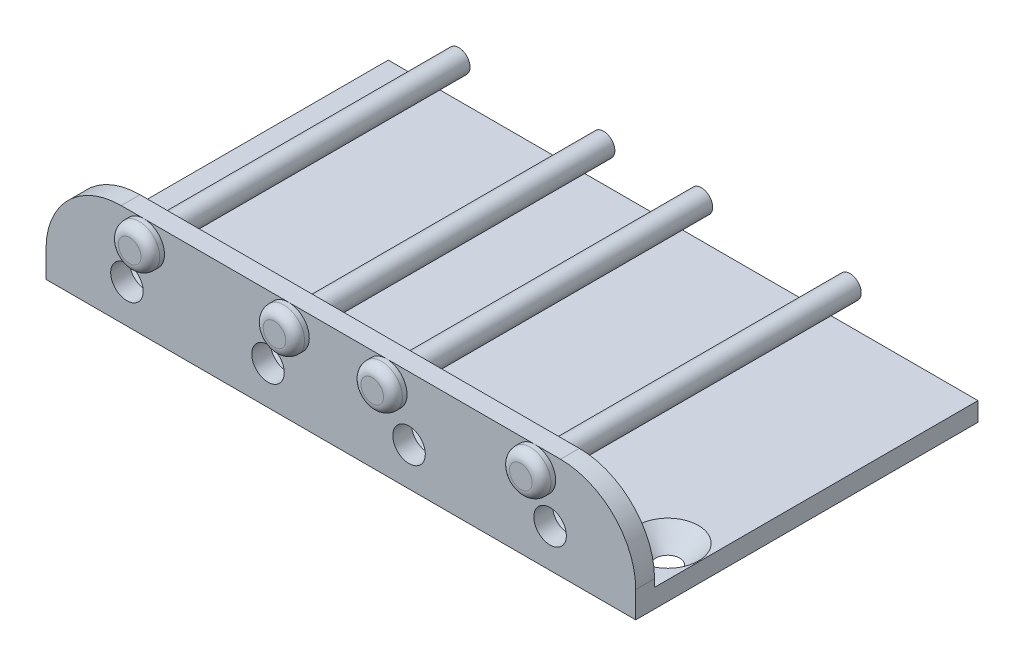
ISO-10303-21;
HEADER;
FILE_DESCRIPTION(('STEP AP214'),'2;1');
FILE_NAME('part.step','',(''),(''),'','','');
FILE_SCHEMA(('AUTOMOTIVE_DESIGN { 1 0 10303 214 1 1 1 1 }'));
ENDSEC;
DATA;
#1=APPLICATION_CONTEXT('core data for automotive mechanical design processes');
#2=APPLICATION_PROTOCOL_DEFINITION('international standard','automotive_design',2000,#1);
#3=PRODUCT_CONTEXT('',#1,'mechanical');
#4=PRODUCT('Part','Part','',(#3));
#5=PRODUCT_RELATED_PRODUCT_CATEGORY('part','',(#4));
#6=PRODUCT_DEFINITION_FORMATION('','',#4);
#7=PRODUCT_DEFINITION_CONTEXT('part definition',#1,'design');
#8=PRODUCT_DEFINITION('design','',#6,#7);
#9=PRODUCT_DEFINITION_SHAPE('','',#8);
#10=(LENGTH_UNIT() NAMED_UNIT(*) SI_UNIT(.MILLI.,.METRE.));
#11=(NAMED_UNIT(*) PLANE_ANGLE_UNIT() SI_UNIT($,.RADIAN.));
#12=(NAMED_UNIT(*) SI_UNIT($,.STERADIAN.) SOLID_ANGLE_UNIT());
#13=UNCERTAINTY_MEASURE_WITH_UNIT(LENGTH_MEASURE(1.E-05),#10,'distance_accuracy_value','');
#14=(GEOMETRIC_REPRESENTATION_CONTEXT(3) GLOBAL_UNCERTAINTY_ASSIGNED_CONTEXT((#13)) GLOBAL_UNIT_ASSIGNED_CONTEXT((#10,
#11,#12)) REPRESENTATION_CONTEXT('',''));
#15=CARTESIAN_POINT('',(0.,0.,0.));
#16=DIRECTION('',(0.,0.,1.));
#17=DIRECTION('',(1.,0.,0.));
#18=AXIS2_PLACEMENT_3D('',#15,#16,#17);
#19=CARTESIAN_POINT('',(0.,2.54,0.));
#20=DIRECTION('',(1.,0.,0.));
#21=DIRECTION('',(0.,0.,-1.));
#22=AXIS2_PLACEMENT_3D('',#19,#20,#21);
#23=PLANE('',#22);
#24=DIRECTION('',(0.,-1.,0.));
#25=VECTOR('',#24,1.);
#26=CARTESIAN_POINT('',(0.,2.54,0.));
#27=LINE('',#26,#25);
#28=CARTESIAN_POINT('',(0.,3.556,0.));
#29=VERTEX_POINT('',#28);
#30=CARTESIAN_POINT('',(0.,0.,0.));
#31=VERTEX_POINT('',#30);
#32=EDGE_CURVE('E223',#29,#31,#27,.T.);
#33=ORIENTED_EDGE('',*,*,#32,.F.);
#34=DIRECTION('',(0.,0.,-1.));
#35=VECTOR('',#34,1.);
#36=CARTESIAN_POINT('',(0.,3.556,-2.54));
#37=LINE('',#36,#35);
#38=CARTESIAN_POINT('',(0.,3.556,-2.54));
#39=VERTEX_POINT('',#38);
#40=EDGE_CURVE('E238',#29,#39,#37,.T.);
#41=ORIENTED_EDGE('',*,*,#40,.T.);
#42=DIRECTION('',(0.,-1.,0.));
#43=VECTOR('',#42,1.);
#44=CARTESIAN_POINT('',(0.,13.716,-2.54));
#45=LINE('',#44,#43);
#46=CARTESIAN_POINT('',(0.,2.54,-2.54));
#47=VERTEX_POINT('',#46);
#48=EDGE_CURVE('E151',#39,#47,#45,.T.);
#49=ORIENTED_EDGE('',*,*,#48,.T.);
#50=DIRECTION('',(0.,0.,1.));
#51=VECTOR('',#50,1.);
#52=CARTESIAN_POINT('',(0.,2.54,0.));
#53=LINE('',#52,#51);
#54=CARTESIAN_POINT('',(0.,2.54,-46.228));
#55=VERTEX_POINT('',#54);
#56=EDGE_CURVE('E463',#55,#47,#53,.T.);
#57=ORIENTED_EDGE('',*,*,#56,.F.);
#58=DIRECTION('',(0.,-1.,0.));
#59=VECTOR('',#58,1.);
#60=CARTESIAN_POINT('',(0.,2.54,-46.228));
#61=LINE('',#60,#59);
#62=CARTESIAN_POINT('',(0.,0.,-46.228));
#63=VERTEX_POINT('',#62);
#64=EDGE_CURVE('E464',#55,#63,#61,.T.);
#65=ORIENTED_EDGE('',*,*,#64,.T.);
#66=DIRECTION('',(0.,0.,1.));
#67=VECTOR('',#66,1.);
#68=CARTESIAN_POINT('',(0.,0.,0.));
#69=LINE('',#68,#67);
#70=EDGE_CURVE('E157',#63,#31,#69,.T.);
#71=ORIENTED_EDGE('',*,*,#70,.T.);
#72=EDGE_LOOP('',(#33,#41,#49,#57,#65,#71));
#73=FACE_BOUND('',#72,.T.);
#74=ADVANCED_FACE('F47',(#73),#23,.F.);
#75=CARTESIAN_POINT('',(0.,2.54,0.));
#76=DIRECTION('',(0.,0.,-1.));
#77=DIRECTION('',(-1.,0.,0.));
#78=AXIS2_PLACEMENT_3D('',#75,#76,#77);
#79=PLANE('',#78);
#80=CARTESIAN_POINT('',(10.9347,5.1689,0.));
#81=DIRECTION('',(0.,0.,1.));
#82=DIRECTION('',(1.,0.,0.));
#83=AXIS2_PLACEMENT_3D('',#80,#81,#82);
#84=CIRCLE('',#83,2.1971);
#85=CARTESIAN_POINT('',(13.1318,5.1689,0.));
#86=VERTEX_POINT('',#85);
#87=EDGE_CURVE('E181',#86,#86,#84,.T.);
#88=ORIENTED_EDGE('',*,*,#87,.F.);
#89=EDGE_LOOP('',(#88));
#90=FACE_BOUND('',#89,.T.);
#91=CARTESIAN_POINT('',(29.9847,5.1689,0.));
#92=DIRECTION('',(0.,0.,1.));
#93=DIRECTION('',(1.,0.,0.));
#94=AXIS2_PLACEMENT_3D('',#91,#92,#93);
#95=CIRCLE('',#94,2.1971);
#96=CARTESIAN_POINT('',(32.1818,5.1689,0.));
#97=VERTEX_POINT('',#96);
#98=EDGE_CURVE('E186',#97,#97,#95,.T.);
#99=ORIENTED_EDGE('',*,*,#98,.F.);
#100=EDGE_LOOP('',(#99));
#101=FACE_BOUND('',#100,.T.);
#102=CARTESIAN_POINT('',(49.0347,5.1689,0.));
#103=DIRECTION('',(0.,0.,1.));
#104=DIRECTION('',(1.,0.,0.));
#105=AXIS2_PLACEMENT_3D('',#102,#103,#104);
#106=CIRCLE('',#105,2.1971);
#107=CARTESIAN_POINT('',(51.2318,5.1689,0.));
#108=VERTEX_POINT('',#107);
#109=EDGE_CURVE('E190',#108,#108,#106,.T.);
#110=ORIENTED_EDGE('',*,*,#109,.F.);
#111=EDGE_LOOP('',(#110));
#112=FACE_BOUND('',#111,.T.);
#113=CARTESIAN_POINT('',(68.0847,5.1689,0.));
#114=DIRECTION('',(0.,0.,1.));
#115=DIRECTION('',(1.,0.,0.));
#116=AXIS2_PLACEMENT_3D('',#113,#114,#115);
#117=CIRCLE('',#116,2.1971);
#118=CARTESIAN_POINT('',(70.2818,5.1689,0.));
#119=VERTEX_POINT('',#118);
#120=EDGE_CURVE('E180',#119,#119,#117,.T.);
#121=ORIENTED_EDGE('',*,*,#120,.F.);
#122=EDGE_LOOP('',(#121));
#123=FACE_BOUND('',#122,.T.);
#124=DIRECTION('',(0.,-1.,0.));
#125=VECTOR('',#124,1.);
#126=CARTESIAN_POINT('',(79.6544,2.54,0.));
#127=LINE('',#126,#125);
#128=CARTESIAN_POINT('',(79.6544,3.556,0.));
#129=VERTEX_POINT('',#128);
#130=CARTESIAN_POINT('',(79.6544,0.,0.));
#131=VERTEX_POINT('',#130);
#132=EDGE_CURVE('E471',#129,#131,#127,.T.);
#133=ORIENTED_EDGE('',*,*,#132,.F.);
#134=CARTESIAN_POINT('',(69.4944,3.556,0.));
#135=DIRECTION('',(0.,0.,-1.));
#136=DIRECTION('',(-1.,0.,0.));
#137=AXIS2_PLACEMENT_3D('',#134,#135,#136);
#138=CIRCLE('',#137,10.16);
#139=CARTESIAN_POINT('',(69.4944,13.716,0.));
#140=VERTEX_POINT('',#139);
#141=EDGE_CURVE('E142',#129,#140,#138,.F.);
#142=ORIENTED_EDGE('',*,*,#141,.T.);
#143=DIRECTION('',(1.,0.,0.));
#144=VECTOR('',#143,1.);
#145=CARTESIAN_POINT('',(-11.4610023994413,13.716,0.));
#146=LINE('',#145,#144);
#147=CARTESIAN_POINT('',(66.04,13.716,0.));
#148=VERTEX_POINT('',#147);
#149=EDGE_CURVE('E130',#148,#140,#146,.T.);
#150=ORIENTED_EDGE('',*,*,#149,.F.);
#151=CARTESIAN_POINT('',(66.04,10.922,0.));
#152=DIRECTION('',(0.,0.,1.));
#153=DIRECTION('',(1.,0.,0.));
#154=AXIS2_PLACEMENT_3D('',#151,#152,#153);
#155=CIRCLE('',#154,2.79400000000001);
#156=EDGE_CURVE('E141',#148,#148,#155,.T.);
#157=ORIENTED_EDGE('',*,*,#156,.F.);
#158=CARTESIAN_POINT('',(45.974,13.716,0.));
#159=VERTEX_POINT('',#158);
#160=EDGE_CURVE('E127',#159,#148,#146,.T.);
#161=ORIENTED_EDGE('',*,*,#160,.F.);
#162=CARTESIAN_POINT('',(45.974,10.922,0.));
#163=DIRECTION('',(0.,0.,1.));
#164=DIRECTION('',(1.,0.,0.));
#165=AXIS2_PLACEMENT_3D('',#162,#163,#164);
#166=CIRCLE('',#165,2.794);
#167=EDGE_CURVE('E165',#159,#159,#166,.T.);
#168=ORIENTED_EDGE('',*,*,#167,.F.);
#169=CARTESIAN_POINT('',(32.766,13.716,0.));
#170=VERTEX_POINT('',#169);
#171=EDGE_CURVE('E132',#170,#159,#146,.T.);
#172=ORIENTED_EDGE('',*,*,#171,.F.);
#173=CARTESIAN_POINT('',(32.766,10.922,0.));
#174=DIRECTION('',(0.,0.,1.));
#175=DIRECTION('',(1.,0.,0.));
#176=AXIS2_PLACEMENT_3D('',#173,#174,#175);
#177=CIRCLE('',#176,2.794);
#178=EDGE_CURVE('E163',#170,#170,#177,.T.);
#179=ORIENTED_EDGE('',*,*,#178,.F.);
#180=CARTESIAN_POINT('',(13.208,13.716,0.));
#181=VERTEX_POINT('',#180);
#182=EDGE_CURVE('E152',#181,#170,#146,.T.);
#183=ORIENTED_EDGE('',*,*,#182,.F.);
#184=CARTESIAN_POINT('',(13.208,10.922,0.));
#185=DIRECTION('',(0.,0.,1.));
#186=DIRECTION('',(1.,0.,0.));
#187=AXIS2_PLACEMENT_3D('',#184,#185,#186);
#188=CIRCLE('',#187,2.794);
#189=EDGE_CURVE('E171',#181,#181,#188,.T.);
#190=ORIENTED_EDGE('',*,*,#189,.F.);
#191=CARTESIAN_POINT('',(10.16,13.716,0.));
#192=VERTEX_POINT('',#191);
#193=EDGE_CURVE('E145',#192,#181,#146,.T.);
#194=ORIENTED_EDGE('',*,*,#193,.F.);
#195=CARTESIAN_POINT('',(10.16,3.556,0.));
#196=DIRECTION('',(0.,0.,-1.));
#197=DIRECTION('',(-1.,0.,0.));
#198=AXIS2_PLACEMENT_3D('',#195,#196,#197);
#199=CIRCLE('',#198,10.16);
#200=EDGE_CURVE('E222',#192,#29,#199,.F.);
#201=ORIENTED_EDGE('',*,*,#200,.T.);
#202=ORIENTED_EDGE('',*,*,#32,.T.);
#203=DIRECTION('',(1.,0.,0.));
#204=VECTOR('',#203,1.);
#205=CARTESIAN_POINT('',(0.,0.,0.));
#206=LINE('',#205,#204);
#207=EDGE_CURVE('E448',#31,#131,#206,.T.);
#208=ORIENTED_EDGE('',*,*,#207,.T.);
#209=EDGE_LOOP('',(#133,#142,#150,#157,#161,#168,#172,#179,#183,#190,#194,#201,#202,#208));
#210=FACE_BOUND('',#209,.T.);
#211=ADVANCED_FACE('F139',(#90,#101,#112,#123,#210),#79,.F.);
#212=CARTESIAN_POINT('',(79.6544,2.54,0.));
#213=DIRECTION('',(-1.,0.,0.));
#214=DIRECTION('',(0.,0.,1.));
#215=AXIS2_PLACEMENT_3D('',#212,#213,#214);
#216=PLANE('',#215);
#217=DIRECTION('',(0.,1.,0.));
#218=VECTOR('',#217,1.);
#219=CARTESIAN_POINT('',(79.6544,13.716,-2.54));
#220=LINE('',#219,#218);
#221=CARTESIAN_POINT('',(79.6544,2.54,-2.54));
#222=VERTEX_POINT('',#221);
#223=CARTESIAN_POINT('',(79.6544,3.556,-2.54));
#224=VERTEX_POINT('',#223);
#225=EDGE_CURVE('E196',#222,#224,#220,.T.);
#226=ORIENTED_EDGE('',*,*,#225,.T.);
#227=DIRECTION('',(0.,0.,1.));
#228=VECTOR('',#227,1.);
#229=CARTESIAN_POINT('',(79.6544,3.556,0.));
#230=LINE('',#229,#228);
#231=EDGE_CURVE('E219',#224,#129,#230,.T.);
#232=ORIENTED_EDGE('',*,*,#231,.T.);
#233=ORIENTED_EDGE('',*,*,#132,.T.);
#234=DIRECTION('',(0.,0.,-1.));
#235=VECTOR('',#234,1.);
#236=CARTESIAN_POINT('',(79.6544,0.,0.));
#237=LINE('',#236,#235);
#238=CARTESIAN_POINT('',(79.6544,0.,-46.228));
#239=VERTEX_POINT('',#238);
#240=EDGE_CURVE('E453',#131,#239,#237,.T.);
#241=ORIENTED_EDGE('',*,*,#240,.T.);
#242=DIRECTION('',(0.,-1.,0.));
#243=VECTOR('',#242,1.);
#244=CARTESIAN_POINT('',(79.6544,2.54,-46.228));
#245=LINE('',#244,#243);
#246=CARTESIAN_POINT('',(79.6544,2.54,-46.228));
#247=VERTEX_POINT('',#246);
#248=EDGE_CURVE('E467',#247,#239,#245,.T.);
#249=ORIENTED_EDGE('',*,*,#248,.F.);
#250=DIRECTION('',(0.,0.,-1.));
#251=VECTOR('',#250,1.);
#252=CARTESIAN_POINT('',(79.6544,2.54,0.));
#253=LINE('',#252,#251);
#254=EDGE_CURVE('E504',#222,#247,#253,.T.);
#255=ORIENTED_EDGE('',*,*,#254,.F.);
#256=EDGE_LOOP('',(#226,#232,#233,#241,#249,#255));
#257=FACE_BOUND('',#256,.T.);
#258=ADVANCED_FACE('F370',(#257),#216,.F.);
#259=CARTESIAN_POINT('',(0.,2.54,-46.228));
#260=DIRECTION('',(0.,0.,1.));
#261=DIRECTION('',(1.,0.,0.));
#262=AXIS2_PLACEMENT_3D('',#259,#260,#261);
#263=PLANE('',#262);
#264=DIRECTION('',(-1.,0.,0.));
#265=VECTOR('',#264,1.);
#266=CARTESIAN_POINT('',(0.,0.,-46.228));
#267=LINE('',#266,#265);
#268=EDGE_CURVE('E446',#239,#63,#267,.T.);
#269=ORIENTED_EDGE('',*,*,#268,.T.);
#270=ORIENTED_EDGE('',*,*,#64,.F.);
#271=DIRECTION('',(-1.,0.,0.));
#272=VECTOR('',#271,1.);
#273=CARTESIAN_POINT('',(0.,2.54,-46.228));
#274=LINE('',#273,#272);
#275=EDGE_CURVE('E456',#247,#55,#274,.T.);
#276=ORIENTED_EDGE('',*,*,#275,.F.);
#277=ORIENTED_EDGE('',*,*,#248,.T.);
#278=EDGE_LOOP('',(#269,#270,#276,#277));
#279=FACE_BOUND('',#278,.T.);
#280=ADVANCED_FACE('F498',(#279),#263,.F.);
#281=CARTESIAN_POINT('',(0.,2.54,0.));
#282=DIRECTION('',(0.,-1.,0.));
#283=DIRECTION('',(0.,0.,-1.));
#284=AXIS2_PLACEMENT_3D('',#281,#282,#283);
#285=PLANE('',#284);
#286=CARTESIAN_POINT('',(75.3872,2.54,-8.59155));
#287=DIRECTION('',(0.,-1.,0.));
#288=DIRECTION('',(0.,0.,-1.));
#289=AXIS2_PLACEMENT_3D('',#286,#287,#288);
#290=CIRCLE('',#289,4.14655000000005);
#291=CARTESIAN_POINT('',(75.3872,2.54,-12.7381000000001));
#292=VERTEX_POINT('',#291);
#293=EDGE_CURVE('E12',#292,#292,#290,.T.);
#294=ORIENTED_EDGE('',*,*,#293,.T.);
#295=EDGE_LOOP('',(#294));
#296=FACE_BOUND('',#295,.T.);
#297=CARTESIAN_POINT('',(57.6072,2.54,-8.59155));
#298=DIRECTION('',(0.,-1.,0.));
#299=DIRECTION('',(0.,0.,-1.));
#300=AXIS2_PLACEMENT_3D('',#297,#298,#299);
#301=CIRCLE('',#300,4.14655000000005);
#302=CARTESIAN_POINT('',(57.6072,2.54,-12.7381000000001));
#303=VERTEX_POINT('',#302);
#304=EDGE_CURVE('E57',#303,#303,#301,.T.);
#305=ORIENTED_EDGE('',*,*,#304,.T.);
#306=EDGE_LOOP('',(#305));
#307=FACE_BOUND('',#306,.T.);
#308=CARTESIAN_POINT('',(39.8272,2.54,-8.59155));
#309=DIRECTION('',(0.,-1.,0.));
#310=DIRECTION('',(0.,0.,-1.));
#311=AXIS2_PLACEMENT_3D('',#308,#309,#310);
#312=CIRCLE('',#311,4.14655000000005);
#313=CARTESIAN_POINT('',(39.8272,2.54,-12.7381000000001));
#314=VERTEX_POINT('',#313);
#315=EDGE_CURVE('E281',#314,#314,#312,.T.);
#316=ORIENTED_EDGE('',*,*,#315,.T.);
#317=EDGE_LOOP('',(#316));
#318=FACE_BOUND('',#317,.T.);
#319=CARTESIAN_POINT('',(4.26720000000001,2.54,-8.59155));
#320=DIRECTION('',(0.,-1.,0.));
#321=DIRECTION('',(0.,0.,-1.));
#322=AXIS2_PLACEMENT_3D('',#319,#320,#321);
#323=CIRCLE('',#322,4.14655000000005);
#324=CARTESIAN_POINT('',(4.26720000000001,2.54,-12.7381000000001));
#325=VERTEX_POINT('',#324);
#326=EDGE_CURVE('E277',#325,#325,#323,.T.);
#327=ORIENTED_EDGE('',*,*,#326,.T.);
#328=EDGE_LOOP('',(#327));
#329=FACE_BOUND('',#328,.T.);
#330=CARTESIAN_POINT('',(22.0472,2.54,-8.59155));
#331=DIRECTION('',(0.,-1.,0.));
#332=DIRECTION('',(0.,0.,-1.));
#333=AXIS2_PLACEMENT_3D('',#330,#331,#332);
#334=CIRCLE('',#333,4.14655000000005);
#335=CARTESIAN_POINT('',(22.0472,2.54,-12.7381000000001));
#336=VERTEX_POINT('',#335);
#337=EDGE_CURVE('E273',#336,#336,#334,.T.);
#338=ORIENTED_EDGE('',*,*,#337,.T.);
#339=EDGE_LOOP('',(#338));
#340=FACE_BOUND('',#339,.T.);
#341=ORIENTED_EDGE('',*,*,#56,.T.);
#342=DIRECTION('',(1.,0.,0.));
#343=VECTOR('',#342,1.);
#344=CARTESIAN_POINT('',(-11.4610023994413,2.54,-2.54));
#345=LINE('',#344,#343);
#346=EDGE_CURVE('E147',#47,#222,#345,.T.);
#347=ORIENTED_EDGE('',*,*,#346,.T.);
#348=ORIENTED_EDGE('',*,*,#254,.T.);
#349=ORIENTED_EDGE('',*,*,#275,.T.);
#350=EDGE_LOOP('',(#341,#347,#348,#349));
#351=FACE_BOUND('',#350,.T.);
#352=ADVANCED_FACE('F288',(#296,#307,#318,#329,#340,#351),#285,.F.);
#353=CARTESIAN_POINT('',(0.,0.,0.));
#354=DIRECTION('',(0.,-1.,0.));
#355=DIRECTION('',(0.,0.,-1.));
#356=AXIS2_PLACEMENT_3D('',#353,#354,#355);
#357=PLANE('',#356);
#358=CARTESIAN_POINT('',(57.6072,0.,-8.59155));
#359=DIRECTION('',(0.,-1.,0.));
#360=DIRECTION('',(0.,0.,-1.));
#361=AXIS2_PLACEMENT_3D('',#358,#359,#360);
#362=CIRCLE('',#361,1.60655);
#363=CARTESIAN_POINT('',(57.6072,0.,-10.1981));
#364=VERTEX_POINT('',#363);
#365=EDGE_CURVE('E299',#364,#364,#362,.T.);
#366=ORIENTED_EDGE('',*,*,#365,.F.);
#367=EDGE_LOOP('',(#366));
#368=FACE_BOUND('',#367,.T.);
#369=CARTESIAN_POINT('',(22.0472,0.,-8.59155));
#370=DIRECTION('',(0.,-1.,0.));
#371=DIRECTION('',(0.,0.,-1.));
#372=AXIS2_PLACEMENT_3D('',#369,#370,#371);
#373=CIRCLE('',#372,1.60655);
#374=CARTESIAN_POINT('',(22.0472,0.,-10.1981));
#375=VERTEX_POINT('',#374);
#376=EDGE_CURVE('E303',#375,#375,#373,.T.);
#377=ORIENTED_EDGE('',*,*,#376,.F.);
#378=EDGE_LOOP('',(#377));
#379=FACE_BOUND('',#378,.T.);
#380=CARTESIAN_POINT('',(4.26720000000001,0.,-8.59155));
#381=DIRECTION('',(0.,-1.,0.));
#382=DIRECTION('',(0.,0.,-1.));
#383=AXIS2_PLACEMENT_3D('',#380,#381,#382);
#384=CIRCLE('',#383,1.60655);
#385=CARTESIAN_POINT('',(4.26720000000001,0.,-10.1981));
#386=VERTEX_POINT('',#385);
#387=EDGE_CURVE('E311',#386,#386,#384,.T.);
#388=ORIENTED_EDGE('',*,*,#387,.F.);
#389=EDGE_LOOP('',(#388));
#390=FACE_BOUND('',#389,.T.);
#391=CARTESIAN_POINT('',(75.3872,0.,-8.59155));
#392=DIRECTION('',(0.,-1.,0.));
#393=DIRECTION('',(0.,0.,-1.));
#394=AXIS2_PLACEMENT_3D('',#391,#392,#393);
#395=CIRCLE('',#394,1.60655);
#396=CARTESIAN_POINT('',(75.3872,0.,-10.1981));
#397=VERTEX_POINT('',#396);
#398=EDGE_CURVE('E314',#397,#397,#395,.T.);
#399=ORIENTED_EDGE('',*,*,#398,.F.);
#400=EDGE_LOOP('',(#399));
#401=FACE_BOUND('',#400,.T.);
#402=CARTESIAN_POINT('',(39.8272,0.,-8.59155));
#403=DIRECTION('',(0.,-1.,0.));
#404=DIRECTION('',(0.,0.,-1.));
#405=AXIS2_PLACEMENT_3D('',#402,#403,#404);
#406=CIRCLE('',#405,1.60655);
#407=CARTESIAN_POINT('',(39.8272,0.,-10.1981));
#408=VERTEX_POINT('',#407);
#409=EDGE_CURVE('E302',#408,#408,#406,.T.);
#410=ORIENTED_EDGE('',*,*,#409,.F.);
#411=EDGE_LOOP('',(#410));
#412=FACE_BOUND('',#411,.T.);
#413=ORIENTED_EDGE('',*,*,#70,.F.);
#414=ORIENTED_EDGE('',*,*,#268,.F.);
#415=ORIENTED_EDGE('',*,*,#240,.F.);
#416=ORIENTED_EDGE('',*,*,#207,.F.);
#417=EDGE_LOOP('',(#413,#414,#415,#416));
#418=FACE_BOUND('',#417,.T.);
#419=ADVANCED_FACE('F435',(#368,#379,#390,#401,#412,#418),#357,.T.);
#420=CARTESIAN_POINT('',(-11.4610023994413,13.716,0.));
#421=DIRECTION('',(0.,1.,0.));
#422=DIRECTION('',(0.,0.,1.));
#423=AXIS2_PLACEMENT_3D('',#420,#421,#422);
#424=PLANE('',#423);
#425=ORIENTED_EDGE('',*,*,#149,.T.);
#426=DIRECTION('',(0.,0.,1.));
#427=VECTOR('',#426,1.);
#428=CARTESIAN_POINT('',(69.4944,13.716,-2.54));
#429=LINE('',#428,#427);
#430=CARTESIAN_POINT('',(69.4944,13.716,-2.54));
#431=VERTEX_POINT('',#430);
#432=EDGE_CURVE('E72',#140,#431,#429,.F.);
#433=ORIENTED_EDGE('',*,*,#432,.T.);
#434=DIRECTION('',(1.,0.,0.));
#435=VECTOR('',#434,1.);
#436=CARTESIAN_POINT('',(-11.4610023994413,13.716,-2.54));
#437=LINE('',#436,#435);
#438=CARTESIAN_POINT('',(10.16,13.716,-2.54));
#439=VERTEX_POINT('',#438);
#440=EDGE_CURVE('E144',#439,#431,#437,.T.);
#441=ORIENTED_EDGE('',*,*,#440,.F.);
#442=DIRECTION('',(0.,0.,-1.));
#443=VECTOR('',#442,1.);
#444=CARTESIAN_POINT('',(10.16,13.716,0.));
#445=LINE('',#444,#443);
#446=EDGE_CURVE('E228',#439,#192,#445,.F.);
#447=ORIENTED_EDGE('',*,*,#446,.T.);
#448=ORIENTED_EDGE('',*,*,#193,.T.);
#449=ORIENTED_EDGE('',*,*,#182,.T.);
#450=ORIENTED_EDGE('',*,*,#171,.T.);
#451=ORIENTED_EDGE('',*,*,#160,.T.);
#452=EDGE_LOOP('',(#425,#433,#441,#447,#448,#449,#450,#451));
#453=FACE_BOUND('',#452,.T.);
#454=ADVANCED_FACE('F129',(#453),#424,.T.);
#455=CARTESIAN_POINT('',(-11.4610023994413,13.716,-2.54));
#456=DIRECTION('',(0.,0.,-1.));
#457=DIRECTION('',(0.,1.,0.));
#458=AXIS2_PLACEMENT_3D('',#455,#456,#457);
#459=PLANE('',#458);
#460=CARTESIAN_POINT('',(13.208,10.922,-2.54));
#461=DIRECTION('',(0.,0.,-1.));
#462=DIRECTION('',(0.,1.,0.));
#463=AXIS2_PLACEMENT_3D('',#460,#461,#462);
#464=CIRCLE('',#463,1.524);
#465=CARTESIAN_POINT('',(13.208,12.446,-2.54));
#466=VERTEX_POINT('',#465);
#467=EDGE_CURVE('E320',#466,#466,#464,.T.);
#468=ORIENTED_EDGE('',*,*,#467,.F.);
#469=EDGE_LOOP('',(#468));
#470=FACE_BOUND('',#469,.T.);
#471=CARTESIAN_POINT('',(32.766,10.922,-2.54));
#472=DIRECTION('',(0.,0.,-1.));
#473=DIRECTION('',(0.,1.,0.));
#474=AXIS2_PLACEMENT_3D('',#471,#472,#473);
#475=CIRCLE('',#474,1.524);
#476=CARTESIAN_POINT('',(32.766,12.446,-2.54));
#477=VERTEX_POINT('',#476);
#478=EDGE_CURVE('E328',#477,#477,#475,.T.);
#479=ORIENTED_EDGE('',*,*,#478,.F.);
#480=EDGE_LOOP('',(#479));
#481=FACE_BOUND('',#480,.T.);
#482=CARTESIAN_POINT('',(45.974,10.922,-2.54));
#483=DIRECTION('',(0.,0.,-1.));
#484=DIRECTION('',(0.,1.,0.));
#485=AXIS2_PLACEMENT_3D('',#482,#483,#484);
#486=CIRCLE('',#485,1.524);
#487=CARTESIAN_POINT('',(45.974,12.446,-2.54));
#488=VERTEX_POINT('',#487);
#489=EDGE_CURVE('E336',#488,#488,#486,.T.);
#490=ORIENTED_EDGE('',*,*,#489,.F.);
#491=EDGE_LOOP('',(#490));
#492=FACE_BOUND('',#491,.T.);
#493=CARTESIAN_POINT('',(66.04,10.922,-2.54));
#494=DIRECTION('',(0.,0.,-1.));
#495=DIRECTION('',(0.,1.,0.));
#496=AXIS2_PLACEMENT_3D('',#493,#494,#495);
#497=CIRCLE('',#496,1.52399999999999);
#498=CARTESIAN_POINT('',(66.04,12.446,-2.54));
#499=VERTEX_POINT('',#498);
#500=EDGE_CURVE('E340',#499,#499,#497,.T.);
#501=ORIENTED_EDGE('',*,*,#500,.F.);
#502=EDGE_LOOP('',(#501));
#503=FACE_BOUND('',#502,.T.);
#504=CARTESIAN_POINT('',(10.9347,5.1689,-2.54));
#505=DIRECTION('',(0.,0.,-1.));
#506=DIRECTION('',(0.,1.,0.));
#507=AXIS2_PLACEMENT_3D('',#504,#505,#506);
#508=CIRCLE('',#507,2.1971);
#509=CARTESIAN_POINT('',(10.9347,7.366,-2.54));
#510=VERTEX_POINT('',#509);
#511=EDGE_CURVE('E199',#510,#510,#508,.T.);
#512=ORIENTED_EDGE('',*,*,#511,.F.);
#513=EDGE_LOOP('',(#512));
#514=FACE_BOUND('',#513,.T.);
#515=CARTESIAN_POINT('',(29.9847,5.1689,-2.54));
#516=DIRECTION('',(0.,0.,-1.));
#517=DIRECTION('',(0.,1.,0.));
#518=AXIS2_PLACEMENT_3D('',#515,#516,#517);
#519=CIRCLE('',#518,2.1971);
#520=CARTESIAN_POINT('',(29.9847,7.366,-2.54));
#521=VERTEX_POINT('',#520);
#522=EDGE_CURVE('E209',#521,#521,#519,.T.);
#523=ORIENTED_EDGE('',*,*,#522,.F.);
#524=EDGE_LOOP('',(#523));
#525=FACE_BOUND('',#524,.T.);
#526=CARTESIAN_POINT('',(49.0347,5.1689,-2.54));
#527=DIRECTION('',(0.,0.,-1.));
#528=DIRECTION('',(0.,1.,0.));
#529=AXIS2_PLACEMENT_3D('',#526,#527,#528);
#530=CIRCLE('',#529,2.1971);
#531=CARTESIAN_POINT('',(49.0347,7.366,-2.54));
#532=VERTEX_POINT('',#531);
#533=EDGE_CURVE('E215',#532,#532,#530,.T.);
#534=ORIENTED_EDGE('',*,*,#533,.F.);
#535=EDGE_LOOP('',(#534));
#536=FACE_BOUND('',#535,.T.);
#537=CARTESIAN_POINT('',(68.0847,5.1689,-2.54));
#538=DIRECTION('',(0.,0.,-1.));
#539=DIRECTION('',(0.,1.,0.));
#540=AXIS2_PLACEMENT_3D('',#537,#538,#539);
#541=CIRCLE('',#540,2.1971);
#542=CARTESIAN_POINT('',(68.0847,7.366,-2.54));
#543=VERTEX_POINT('',#542);
#544=EDGE_CURVE('E185',#543,#543,#541,.T.);
#545=ORIENTED_EDGE('',*,*,#544,.F.);
#546=EDGE_LOOP('',(#545));
#547=FACE_BOUND('',#546,.T.);
#548=ORIENTED_EDGE('',*,*,#440,.T.);
#549=CARTESIAN_POINT('',(69.4944,3.556,-2.54));
#550=DIRECTION('',(0.,0.,-1.));
#551=DIRECTION('',(0.,1.,0.));
#552=AXIS2_PLACEMENT_3D('',#549,#550,#551);
#553=CIRCLE('',#552,10.16);
#554=EDGE_CURVE('E235',#431,#224,#553,.T.);
#555=ORIENTED_EDGE('',*,*,#554,.T.);
#556=ORIENTED_EDGE('',*,*,#225,.F.);
#557=ORIENTED_EDGE('',*,*,#346,.F.);
#558=ORIENTED_EDGE('',*,*,#48,.F.);
#559=CARTESIAN_POINT('',(10.16,3.556,-2.54));
#560=DIRECTION('',(0.,0.,-1.));
#561=DIRECTION('',(0.,1.,0.));
#562=AXIS2_PLACEMENT_3D('',#559,#560,#561);
#563=CIRCLE('',#562,10.16);
#564=EDGE_CURVE('E64',#39,#439,#563,.T.);
#565=ORIENTED_EDGE('',*,*,#564,.T.);
#566=EDGE_LOOP('',(#548,#555,#556,#557,#558,#565));
#567=FACE_BOUND('',#566,.T.);
#568=ADVANCED_FACE('F485',(#470,#481,#492,#503,#514,#525,#536,#547,#567),#459,.T.);
#569=CARTESIAN_POINT('',(68.0847,5.1689,-46.228));
#570=DIRECTION('',(0.,0.,1.));
#571=DIRECTION('',(1.,0.,0.));
#572=AXIS2_PLACEMENT_3D('',#569,#570,#571);
#573=CYLINDRICAL_SURFACE('',#572,2.1971);
#574=ORIENTED_EDGE('',*,*,#544,.T.);
#575=EDGE_LOOP('',(#574));
#576=FACE_BOUND('',#575,.T.);
#577=ORIENTED_EDGE('',*,*,#120,.T.);
#578=EDGE_LOOP('',(#577));
#579=FACE_BOUND('',#578,.T.);
#580=ADVANCED_FACE('F488',(#576,#579),#573,.F.);
#581=CARTESIAN_POINT('',(49.0347,5.1689,-46.228));
#582=DIRECTION('',(0.,0.,1.));
#583=DIRECTION('',(1.,0.,0.));
#584=AXIS2_PLACEMENT_3D('',#581,#582,#583);
#585=CYLINDRICAL_SURFACE('',#584,2.1971);
#586=ORIENTED_EDGE('',*,*,#533,.T.);
#587=EDGE_LOOP('',(#586));
#588=FACE_BOUND('',#587,.T.);
#589=ORIENTED_EDGE('',*,*,#109,.T.);
#590=EDGE_LOOP('',(#589));
#591=FACE_BOUND('',#590,.T.);
#592=ADVANCED_FACE('F482',(#588,#591),#585,.F.);
#593=CARTESIAN_POINT('',(29.9847,5.1689,-46.228));
#594=DIRECTION('',(0.,0.,1.));
#595=DIRECTION('',(1.,0.,0.));
#596=AXIS2_PLACEMENT_3D('',#593,#594,#595);
#597=CYLINDRICAL_SURFACE('',#596,2.1971);
#598=ORIENTED_EDGE('',*,*,#522,.T.);
#599=EDGE_LOOP('',(#598));
#600=FACE_BOUND('',#599,.T.);
#601=ORIENTED_EDGE('',*,*,#98,.T.);
#602=EDGE_LOOP('',(#601));
#603=FACE_BOUND('',#602,.T.);
#604=ADVANCED_FACE('F524',(#600,#603),#597,.F.);
#605=CARTESIAN_POINT('',(10.9347,5.1689,-46.228));
#606=DIRECTION('',(0.,0.,1.));
#607=DIRECTION('',(1.,0.,0.));
#608=AXIS2_PLACEMENT_3D('',#605,#606,#607);
#609=CYLINDRICAL_SURFACE('',#608,2.1971);
#610=ORIENTED_EDGE('',*,*,#511,.T.);
#611=EDGE_LOOP('',(#610));
#612=FACE_BOUND('',#611,.T.);
#613=ORIENTED_EDGE('',*,*,#87,.T.);
#614=EDGE_LOOP('',(#613));
#615=FACE_BOUND('',#614,.T.);
#616=ADVANCED_FACE('F514',(#612,#615),#609,.F.);
#617=CARTESIAN_POINT('',(13.208,10.922,1.905));
#618=DIRECTION('',(0.,0.,-1.));
#619=DIRECTION('',(-1.,0.,0.));
#620=AXIS2_PLACEMENT_3D('',#617,#618,#619);
#621=CYLINDRICAL_SURFACE('',#620,2.794);
#622=CARTESIAN_POINT('',(13.208,10.922,0.634999999999999));
#623=DIRECTION('',(0.,0.,1.));
#624=DIRECTION('',(1.,0.,0.));
#625=AXIS2_PLACEMENT_3D('',#622,#623,#624);
#626=CIRCLE('',#625,2.794);
#627=CARTESIAN_POINT('',(16.002,10.922,0.634999999999999));
#628=VERTEX_POINT('',#627);
#629=EDGE_CURVE('E269',#628,#628,#626,.F.);
#630=ORIENTED_EDGE('',*,*,#629,.T.);
#631=EDGE_LOOP('',(#630));
#632=FACE_BOUND('',#631,.T.);
#633=ORIENTED_EDGE('',*,*,#189,.T.);
#634=EDGE_LOOP('',(#633));
#635=FACE_BOUND('',#634,.T.);
#636=ADVANCED_FACE('F511',(#632,#635),#621,.T.);
#637=CARTESIAN_POINT('',(13.208,10.922,1.905));
#638=DIRECTION('',(0.,0.,1.));
#639=DIRECTION('',(1.,0.,0.));
#640=AXIS2_PLACEMENT_3D('',#637,#638,#639);
#641=PLANE('',#640);
#642=CARTESIAN_POINT('',(13.208,10.922,1.905));
#643=DIRECTION('',(0.,0.,1.));
#644=DIRECTION('',(1.,0.,0.));
#645=AXIS2_PLACEMENT_3D('',#642,#643,#644);
#646=CIRCLE('',#645,1.524);
#647=CARTESIAN_POINT('',(14.732,10.922,1.905));
#648=VERTEX_POINT('',#647);
#649=EDGE_CURVE('E265',#648,#648,#646,.T.);
#650=ORIENTED_EDGE('',*,*,#649,.T.);
#651=EDGE_LOOP('',(#650));
#652=FACE_BOUND('',#651,.T.);
#653=ADVANCED_FACE('F513',(#652),#641,.T.);
#654=CARTESIAN_POINT('',(32.766,10.922,1.905));
#655=DIRECTION('',(0.,0.,-1.));
#656=DIRECTION('',(-1.,0.,0.));
#657=AXIS2_PLACEMENT_3D('',#654,#655,#656);
#658=CYLINDRICAL_SURFACE('',#657,2.794);
#659=CARTESIAN_POINT('',(32.766,10.922,0.634999999999999));
#660=DIRECTION('',(0.,0.,1.));
#661=DIRECTION('',(1.,0.,0.));
#662=AXIS2_PLACEMENT_3D('',#659,#660,#661);
#663=CIRCLE('',#662,2.794);
#664=CARTESIAN_POINT('',(35.56,10.922,0.634999999999999));
#665=VERTEX_POINT('',#664);
#666=EDGE_CURVE('E261',#665,#665,#663,.F.);
#667=ORIENTED_EDGE('',*,*,#666,.T.);
#668=EDGE_LOOP('',(#667));
#669=FACE_BOUND('',#668,.T.);
#670=ORIENTED_EDGE('',*,*,#178,.T.);
#671=EDGE_LOOP('',(#670));
#672=FACE_BOUND('',#671,.T.);
#673=ADVANCED_FACE('F521',(#669,#672),#658,.T.);
#674=CARTESIAN_POINT('',(32.766,10.922,1.905));
#675=DIRECTION('',(0.,0.,1.));
#676=DIRECTION('',(1.,0.,0.));
#677=AXIS2_PLACEMENT_3D('',#674,#675,#676);
#678=PLANE('',#677);
#679=CARTESIAN_POINT('',(32.766,10.922,1.905));
#680=DIRECTION('',(0.,0.,1.));
#681=DIRECTION('',(1.,0.,0.));
#682=AXIS2_PLACEMENT_3D('',#679,#680,#681);
#683=CIRCLE('',#682,1.524);
#684=CARTESIAN_POINT('',(34.29,10.922,1.905));
#685=VERTEX_POINT('',#684);
#686=EDGE_CURVE('E257',#685,#685,#683,.T.);
#687=ORIENTED_EDGE('',*,*,#686,.T.);
#688=EDGE_LOOP('',(#687));
#689=FACE_BOUND('',#688,.T.);
#690=ADVANCED_FACE('F650',(#689),#678,.T.);
#691=CARTESIAN_POINT('',(45.974,10.922,1.905));
#692=DIRECTION('',(0.,0.,-1.));
#693=DIRECTION('',(-1.,0.,0.));
#694=AXIS2_PLACEMENT_3D('',#691,#692,#693);
#695=CYLINDRICAL_SURFACE('',#694,2.794);
#696=CARTESIAN_POINT('',(45.974,10.922,0.634999999999999));
#697=DIRECTION('',(0.,0.,1.));
#698=DIRECTION('',(1.,0.,0.));
#699=AXIS2_PLACEMENT_3D('',#696,#697,#698);
#700=CIRCLE('',#699,2.794);
#701=CARTESIAN_POINT('',(48.768,10.922,0.634999999999999));
#702=VERTEX_POINT('',#701);
#703=EDGE_CURVE('E253',#702,#702,#700,.F.);
#704=ORIENTED_EDGE('',*,*,#703,.T.);
#705=EDGE_LOOP('',(#704));
#706=FACE_BOUND('',#705,.T.);
#707=ORIENTED_EDGE('',*,*,#167,.T.);
#708=EDGE_LOOP('',(#707));
#709=FACE_BOUND('',#708,.T.);
#710=ADVANCED_FACE('F660',(#706,#709),#695,.T.);
#711=CARTESIAN_POINT('',(45.974,10.922,1.905));
#712=DIRECTION('',(0.,0.,1.));
#713=DIRECTION('',(1.,0.,0.));
#714=AXIS2_PLACEMENT_3D('',#711,#712,#713);
#715=PLANE('',#714);
#716=CARTESIAN_POINT('',(45.974,10.922,1.905));
#717=DIRECTION('',(0.,0.,1.));
#718=DIRECTION('',(1.,0.,0.));
#719=AXIS2_PLACEMENT_3D('',#716,#717,#718);
#720=CIRCLE('',#719,1.524);
#721=CARTESIAN_POINT('',(47.498,10.922,1.905));
#722=VERTEX_POINT('',#721);
#723=EDGE_CURVE('E249',#722,#722,#720,.T.);
#724=ORIENTED_EDGE('',*,*,#723,.T.);
#725=EDGE_LOOP('',(#724));
#726=FACE_BOUND('',#725,.T.);
#727=ADVANCED_FACE('F669',(#726),#715,.T.);
#728=CARTESIAN_POINT('',(66.04,10.922,1.905));
#729=DIRECTION('',(0.,0.,-1.));
#730=DIRECTION('',(-1.,0.,0.));
#731=AXIS2_PLACEMENT_3D('',#728,#729,#730);
#732=CYLINDRICAL_SURFACE('',#731,2.79400000000001);
#733=CARTESIAN_POINT('',(66.04,10.922,0.634999999999999));
#734=DIRECTION('',(0.,0.,1.));
#735=DIRECTION('',(1.,0.,0.));
#736=AXIS2_PLACEMENT_3D('',#733,#734,#735);
#737=CIRCLE('',#736,2.79400000000001);
#738=CARTESIAN_POINT('',(68.834,10.922,0.634999999999999));
#739=VERTEX_POINT('',#738);
#740=EDGE_CURVE('E245',#739,#739,#737,.F.);
#741=ORIENTED_EDGE('',*,*,#740,.T.);
#742=EDGE_LOOP('',(#741));
#743=FACE_BOUND('',#742,.T.);
#744=ORIENTED_EDGE('',*,*,#156,.T.);
#745=EDGE_LOOP('',(#744));
#746=FACE_BOUND('',#745,.T.);
#747=ADVANCED_FACE('F679',(#743,#746),#732,.T.);
#748=CARTESIAN_POINT('',(66.04,10.922,1.905));
#749=DIRECTION('',(0.,0.,1.));
#750=DIRECTION('',(1.,0.,0.));
#751=AXIS2_PLACEMENT_3D('',#748,#749,#750);
#752=PLANE('',#751);
#753=CARTESIAN_POINT('',(66.04,10.922,1.905));
#754=DIRECTION('',(0.,0.,1.));
#755=DIRECTION('',(1.,0.,0.));
#756=AXIS2_PLACEMENT_3D('',#753,#754,#755);
#757=CIRCLE('',#756,1.52400000000001);
#758=CARTESIAN_POINT('',(67.564,10.922,1.905));
#759=VERTEX_POINT('',#758);
#760=EDGE_CURVE('E241',#759,#759,#757,.T.);
#761=ORIENTED_EDGE('',*,*,#760,.T.);
#762=EDGE_LOOP('',(#761));
#763=FACE_BOUND('',#762,.T.);
#764=ADVANCED_FACE('F380',(#763),#752,.T.);
#765=CARTESIAN_POINT('',(69.4944,3.556,0.));
#766=DIRECTION('',(0.,0.,-1.));
#767=DIRECTION('',(-1.,0.,0.));
#768=AXIS2_PLACEMENT_3D('',#765,#766,#767);
#769=CYLINDRICAL_SURFACE('',#768,10.16);
#770=ORIENTED_EDGE('',*,*,#554,.F.);
#771=ORIENTED_EDGE('',*,*,#432,.F.);
#772=ORIENTED_EDGE('',*,*,#141,.F.);
#773=ORIENTED_EDGE('',*,*,#231,.F.);
#774=EDGE_LOOP('',(#770,#771,#772,#773));
#775=FACE_BOUND('',#774,.T.);
#776=ADVANCED_FACE('F376',(#775),#769,.T.);
#777=CARTESIAN_POINT('',(10.16,3.556,0.));
#778=DIRECTION('',(0.,0.,1.));
#779=DIRECTION('',(1.,0.,0.));
#780=AXIS2_PLACEMENT_3D('',#777,#778,#779);
#781=CYLINDRICAL_SURFACE('',#780,10.16);
#782=ORIENTED_EDGE('',*,*,#200,.F.);
#783=ORIENTED_EDGE('',*,*,#446,.F.);
#784=ORIENTED_EDGE('',*,*,#564,.F.);
#785=ORIENTED_EDGE('',*,*,#40,.F.);
#786=EDGE_LOOP('',(#782,#783,#784,#785));
#787=FACE_BOUND('',#786,.T.);
#788=ADVANCED_FACE('F379',(#787),#781,.T.);
#789=CARTESIAN_POINT('',(66.04,10.922,0.635));
#790=DIRECTION('',(0.,0.,1.));
#791=DIRECTION('',(1.,0.,0.));
#792=AXIS2_PLACEMENT_3D('',#789,#790,#791);
#793=TOROIDAL_SURFACE('',#792,1.52400000000001,1.27);
#794=ORIENTED_EDGE('',*,*,#740,.F.);
#795=EDGE_LOOP('',(#794));
#796=FACE_BOUND('',#795,.T.);
#797=ORIENTED_EDGE('',*,*,#760,.F.);
#798=EDGE_LOOP('',(#797));
#799=FACE_BOUND('',#798,.T.);
#800=ADVANCED_FACE('F384',(#796,#799),#793,.T.);
#801=CARTESIAN_POINT('',(45.974,10.922,0.635));
#802=DIRECTION('',(0.,0.,1.));
#803=DIRECTION('',(1.,0.,0.));
#804=AXIS2_PLACEMENT_3D('',#801,#802,#803);
#805=TOROIDAL_SURFACE('',#804,1.524,1.27);
#806=ORIENTED_EDGE('',*,*,#703,.F.);
#807=EDGE_LOOP('',(#806));
#808=FACE_BOUND('',#807,.T.);
#809=ORIENTED_EDGE('',*,*,#723,.F.);
#810=EDGE_LOOP('',(#809));
#811=FACE_BOUND('',#810,.T.);
#812=ADVANCED_FACE('F387',(#808,#811),#805,.T.);
#813=CARTESIAN_POINT('',(32.766,10.922,0.635));
#814=DIRECTION('',(0.,0.,1.));
#815=DIRECTION('',(1.,0.,0.));
#816=AXIS2_PLACEMENT_3D('',#813,#814,#815);
#817=TOROIDAL_SURFACE('',#816,1.524,1.27);
#818=ORIENTED_EDGE('',*,*,#666,.F.);
#819=EDGE_LOOP('',(#818));
#820=FACE_BOUND('',#819,.T.);
#821=ORIENTED_EDGE('',*,*,#686,.F.);
#822=EDGE_LOOP('',(#821));
#823=FACE_BOUND('',#822,.T.);
#824=ADVANCED_FACE('F391',(#820,#823),#817,.T.);
#825=CARTESIAN_POINT('',(13.208,10.922,0.635));
#826=DIRECTION('',(0.,0.,1.));
#827=DIRECTION('',(1.,0.,0.));
#828=AXIS2_PLACEMENT_3D('',#825,#826,#827);
#829=TOROIDAL_SURFACE('',#828,1.524,1.27);
#830=ORIENTED_EDGE('',*,*,#629,.F.);
#831=EDGE_LOOP('',(#830));
#832=FACE_BOUND('',#831,.T.);
#833=ORIENTED_EDGE('',*,*,#649,.F.);
#834=EDGE_LOOP('',(#833));
#835=FACE_BOUND('',#834,.T.);
#836=ADVANCED_FACE('F361',(#832,#835),#829,.T.);
#837=CARTESIAN_POINT('',(66.04,10.922,-91.3055229381132));
#838=DIRECTION('',(0.,0.,1.));
#839=DIRECTION('',(0.,-1.,0.));
#840=AXIS2_PLACEMENT_3D('',#837,#838,#839);
#841=CYLINDRICAL_SURFACE('',#840,1.52399999999999);
#842=CARTESIAN_POINT('',(66.04,10.922,-42.545));
#843=DIRECTION('',(0.,0.,1.));
#844=DIRECTION('',(1.,0.,0.));
#845=AXIS2_PLACEMENT_3D('',#842,#843,#844);
#846=CIRCLE('',#845,1.52399999999999);
#847=CARTESIAN_POINT('',(67.564,10.922,-42.545));
#848=VERTEX_POINT('',#847);
#849=EDGE_CURVE('E173',#848,#848,#846,.T.);
#850=ORIENTED_EDGE('',*,*,#849,.T.);
#851=EDGE_LOOP('',(#850));
#852=FACE_BOUND('',#851,.T.);
#853=ORIENTED_EDGE('',*,*,#500,.T.);
#854=EDGE_LOOP('',(#853));
#855=FACE_BOUND('',#854,.T.);
#856=ADVANCED_FACE('F347',(#852,#855),#841,.T.);
#857=CARTESIAN_POINT('',(66.04,10.922,-42.545));
#858=DIRECTION('',(0.,0.,1.));
#859=DIRECTION('',(1.,0.,0.));
#860=AXIS2_PLACEMENT_3D('',#857,#858,#859);
#861=PLANE('',#860);
#862=ORIENTED_EDGE('',*,*,#849,.F.);
#863=EDGE_LOOP('',(#862));
#864=FACE_BOUND('',#863,.T.);
#865=ADVANCED_FACE('F350',(#864),#861,.F.);
#866=CARTESIAN_POINT('',(45.974,10.922,-91.3055229381132));
#867=DIRECTION('',(0.,0.,1.));
#868=DIRECTION('',(0.,-1.,0.));
#869=AXIS2_PLACEMENT_3D('',#866,#867,#868);
#870=CYLINDRICAL_SURFACE('',#869,1.524);
#871=CARTESIAN_POINT('',(45.974,10.922,-42.545));
#872=DIRECTION('',(0.,0.,1.));
#873=DIRECTION('',(1.,0.,0.));
#874=AXIS2_PLACEMENT_3D('',#871,#872,#873);
#875=CIRCLE('',#874,1.524);
#876=CARTESIAN_POINT('',(47.498,10.922,-42.545));
#877=VERTEX_POINT('',#876);
#878=EDGE_CURVE('E332',#877,#877,#875,.T.);
#879=ORIENTED_EDGE('',*,*,#878,.T.);
#880=EDGE_LOOP('',(#879));
#881=FACE_BOUND('',#880,.T.);
#882=ORIENTED_EDGE('',*,*,#489,.T.);
#883=EDGE_LOOP('',(#882));
#884=FACE_BOUND('',#883,.T.);
#885=ADVANCED_FACE('F352',(#881,#884),#870,.T.);
#886=CARTESIAN_POINT('',(66.04,10.922,-42.545));
#887=DIRECTION('',(0.,0.,1.));
#888=DIRECTION('',(1.,0.,0.));
#889=AXIS2_PLACEMENT_3D('',#886,#887,#888);
#890=PLANE('',#889);
#891=ORIENTED_EDGE('',*,*,#878,.F.);
#892=EDGE_LOOP('',(#891));
#893=FACE_BOUND('',#892,.T.);
#894=ADVANCED_FACE('F358',(#893),#890,.F.);
#895=CARTESIAN_POINT('',(32.766,10.922,-91.3055229381132));
#896=DIRECTION('',(0.,0.,1.));
#897=DIRECTION('',(0.,-1.,0.));
#898=AXIS2_PLACEMENT_3D('',#895,#896,#897);
#899=CYLINDRICAL_SURFACE('',#898,1.524);
#900=CARTESIAN_POINT('',(32.766,10.922,-42.545));
#901=DIRECTION('',(0.,0.,1.));
#902=DIRECTION('',(1.,0.,0.));
#903=AXIS2_PLACEMENT_3D('',#900,#901,#902);
#904=CIRCLE('',#903,1.524);
#905=CARTESIAN_POINT('',(34.29,10.922,-42.545));
#906=VERTEX_POINT('',#905);
#907=EDGE_CURVE('E324',#906,#906,#904,.T.);
#908=ORIENTED_EDGE('',*,*,#907,.T.);
#909=EDGE_LOOP('',(#908));
#910=FACE_BOUND('',#909,.T.);
#911=ORIENTED_EDGE('',*,*,#478,.T.);
#912=EDGE_LOOP('',(#911));
#913=FACE_BOUND('',#912,.T.);
#914=ADVANCED_FACE('F757',(#910,#913),#899,.T.);
#915=CARTESIAN_POINT('',(66.04,10.922,-42.545));
#916=DIRECTION('',(0.,0.,1.));
#917=DIRECTION('',(1.,0.,0.));
#918=AXIS2_PLACEMENT_3D('',#915,#916,#917);
#919=PLANE('',#918);
#920=ORIENTED_EDGE('',*,*,#907,.F.);
#921=EDGE_LOOP('',(#920));
#922=FACE_BOUND('',#921,.T.);
#923=ADVANCED_FACE('F766',(#922),#919,.F.);
#924=CARTESIAN_POINT('',(13.208,10.922,-91.3055229381132));
#925=DIRECTION('',(0.,0.,1.));
#926=DIRECTION('',(0.,-1.,0.));
#927=AXIS2_PLACEMENT_3D('',#924,#925,#926);
#928=CYLINDRICAL_SURFACE('',#927,1.524);
#929=CARTESIAN_POINT('',(13.208,10.922,-42.545));
#930=DIRECTION('',(0.,0.,1.));
#931=DIRECTION('',(1.,0.,0.));
#932=AXIS2_PLACEMENT_3D('',#929,#930,#931);
#933=CIRCLE('',#932,1.524);
#934=CARTESIAN_POINT('',(14.732,10.922,-42.545));
#935=VERTEX_POINT('',#934);
#936=EDGE_CURVE('E308',#935,#935,#933,.T.);
#937=ORIENTED_EDGE('',*,*,#936,.T.);
#938=EDGE_LOOP('',(#937));
#939=FACE_BOUND('',#938,.T.);
#940=ORIENTED_EDGE('',*,*,#467,.T.);
#941=EDGE_LOOP('',(#940));
#942=FACE_BOUND('',#941,.T.);
#943=ADVANCED_FACE('F776',(#939,#942),#928,.T.);
#944=CARTESIAN_POINT('',(66.04,10.922,-42.545));
#945=DIRECTION('',(0.,0.,1.));
#946=DIRECTION('',(1.,0.,0.));
#947=AXIS2_PLACEMENT_3D('',#944,#945,#946);
#948=PLANE('',#947);
#949=ORIENTED_EDGE('',*,*,#936,.F.);
#950=EDGE_LOOP('',(#949));
#951=FACE_BOUND('',#950,.T.);
#952=ADVANCED_FACE('F404',(#951),#948,.F.);
#953=CARTESIAN_POINT('',(75.3872,0.,-8.59155));
#954=DIRECTION('',(0.,1.,0.));
#955=DIRECTION('',(0.,0.,1.));
#956=AXIS2_PLACEMENT_3D('',#953,#954,#955);
#957=CONICAL_SURFACE('',#956,1.60655,0.785398163397452);
#958=ORIENTED_EDGE('',*,*,#293,.F.);
#959=EDGE_LOOP('',(#958));
#960=FACE_BOUND('',#959,.T.);
#961=ORIENTED_EDGE('',*,*,#398,.T.);
#962=EDGE_LOOP('',(#961));
#963=FACE_BOUND('',#962,.T.);
#964=ADVANCED_FACE('F295',(#960,#963),#957,.F.);
#965=CARTESIAN_POINT('',(57.6072,0.,-8.59155));
#966=DIRECTION('',(0.,1.,0.));
#967=DIRECTION('',(0.,0.,1.));
#968=AXIS2_PLACEMENT_3D('',#965,#966,#967);
#969=CONICAL_SURFACE('',#968,1.60655,0.785398163397452);
#970=ORIENTED_EDGE('',*,*,#304,.F.);
#971=EDGE_LOOP('',(#970));
#972=FACE_BOUND('',#971,.T.);
#973=ORIENTED_EDGE('',*,*,#365,.T.);
#974=EDGE_LOOP('',(#973));
#975=FACE_BOUND('',#974,.T.);
#976=ADVANCED_FACE('F291',(#972,#975),#969,.F.);
#977=CARTESIAN_POINT('',(39.8272,0.,-8.59155));
#978=DIRECTION('',(0.,1.,0.));
#979=DIRECTION('',(0.,0.,1.));
#980=AXIS2_PLACEMENT_3D('',#977,#978,#979);
#981=CONICAL_SURFACE('',#980,1.60655,0.785398163397452);
#982=ORIENTED_EDGE('',*,*,#315,.F.);
#983=EDGE_LOOP('',(#982));
#984=FACE_BOUND('',#983,.T.);
#985=ORIENTED_EDGE('',*,*,#409,.T.);
#986=EDGE_LOOP('',(#985));
#987=FACE_BOUND('',#986,.T.);
#988=ADVANCED_FACE('F294',(#984,#987),#981,.F.);
#989=CARTESIAN_POINT('',(4.26720000000001,0.,-8.59155));
#990=DIRECTION('',(0.,1.,0.));
#991=DIRECTION('',(0.,0.,1.));
#992=AXIS2_PLACEMENT_3D('',#989,#990,#991);
#993=CONICAL_SURFACE('',#992,1.60655,0.785398163397452);
#994=ORIENTED_EDGE('',*,*,#326,.F.);
#995=EDGE_LOOP('',(#994));
#996=FACE_BOUND('',#995,.T.);
#997=ORIENTED_EDGE('',*,*,#387,.T.);
#998=EDGE_LOOP('',(#997));
#999=FACE_BOUND('',#998,.T.);
#1000=ADVANCED_FACE('F414',(#996,#999),#993,.F.);
#1001=CARTESIAN_POINT('',(22.0472,0.,-8.59155));
#1002=DIRECTION('',(0.,1.,0.));
#1003=DIRECTION('',(0.,0.,1.));
#1004=AXIS2_PLACEMENT_3D('',#1001,#1002,#1003);
#1005=CONICAL_SURFACE('',#1004,1.60655,0.785398163397452);
#1006=ORIENTED_EDGE('',*,*,#337,.F.);
#1007=EDGE_LOOP('',(#1006));
#1008=FACE_BOUND('',#1007,.T.);
#1009=ORIENTED_EDGE('',*,*,#376,.T.);
#1010=EDGE_LOOP('',(#1009));
#1011=FACE_BOUND('',#1010,.T.);
#1012=ADVANCED_FACE('F50',(#1008,#1011),#1005,.F.);
#1013=CLOSED_SHELL('',(#74,#211,#258,#280,#352,#419,#454,#568,#580,#592,#604,#616,#636,#653,
#673,#690,#710,#727,#747,#764,#776,#788,#800,#812,#824,#836,#856,#865,#885,#894,#914,#923,#943,
#952,#964,#976,#988,#1000,#1012));
#1014=MANIFOLD_SOLID_BREP('B2',#1013);
#1015=ADVANCED_BREP_SHAPE_REPRESENTATION('',(#18,#1014),#14);
#1016=SHAPE_DEFINITION_REPRESENTATION(#9,#1015);
ENDSEC;
END-ISO-10303-21;
